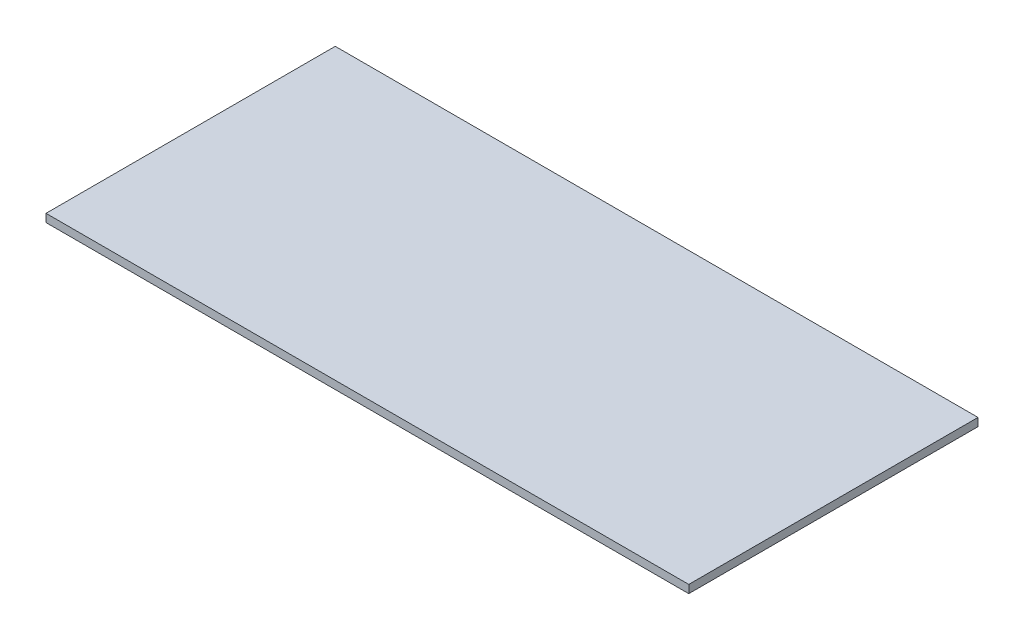
ISO-10303-21;
HEADER;
FILE_DESCRIPTION(('STEP AP214'),'2;1');
FILE_NAME('part.step','',(''),(''),'','','');
FILE_SCHEMA(('AUTOMOTIVE_DESIGN { 1 0 10303 214 1 1 1 1 }'));
ENDSEC;
DATA;
#1=APPLICATION_CONTEXT('core data for automotive mechanical design processes');
#2=APPLICATION_PROTOCOL_DEFINITION('international standard','automotive_design',2000,#1);
#3=PRODUCT_CONTEXT('',#1,'mechanical');
#4=PRODUCT('Part','Part','',(#3));
#5=PRODUCT_RELATED_PRODUCT_CATEGORY('part','',(#4));
#6=PRODUCT_DEFINITION_FORMATION('','',#4);
#7=PRODUCT_DEFINITION_CONTEXT('part definition',#1,'design');
#8=PRODUCT_DEFINITION('design','',#6,#7);
#9=PRODUCT_DEFINITION_SHAPE('','',#8);
#10=(LENGTH_UNIT() NAMED_UNIT(*) SI_UNIT(.MILLI.,.METRE.));
#11=(NAMED_UNIT(*) PLANE_ANGLE_UNIT() SI_UNIT($,.RADIAN.));
#12=(NAMED_UNIT(*) SI_UNIT($,.STERADIAN.) SOLID_ANGLE_UNIT());
#13=UNCERTAINTY_MEASURE_WITH_UNIT(LENGTH_MEASURE(1.E-05),#10,'distance_accuracy_value','');
#14=(GEOMETRIC_REPRESENTATION_CONTEXT(3) GLOBAL_UNCERTAINTY_ASSIGNED_CONTEXT((#13)) GLOBAL_UNIT_ASSIGNED_CONTEXT((#10,
#11,#12)) REPRESENTATION_CONTEXT('',''));
#15=CARTESIAN_POINT('',(0.,0.,0.));
#16=DIRECTION('',(0.,0.,1.));
#17=DIRECTION('',(1.,0.,0.));
#18=AXIS2_PLACEMENT_3D('',#15,#16,#17);
#19=CARTESIAN_POINT('',(400.,10.,-180.));
#20=DIRECTION('',(-1.,0.,0.));
#21=DIRECTION('',(0.,0.,1.));
#22=AXIS2_PLACEMENT_3D('',#19,#20,#21);
#23=PLANE('',#22);
#24=DIRECTION('',(0.,0.,-1.));
#25=VECTOR('',#24,1.);
#26=CARTESIAN_POINT('',(400.,0.,-180.));
#27=LINE('',#26,#25);
#28=CARTESIAN_POINT('',(400.,0.,180.));
#29=VERTEX_POINT('',#28);
#30=CARTESIAN_POINT('',(400.,0.,-180.));
#31=VERTEX_POINT('',#30);
#32=EDGE_CURVE('E99',#29,#31,#27,.T.);
#33=ORIENTED_EDGE('',*,*,#32,.T.);
#34=DIRECTION('',(0.,-1.,0.));
#35=VECTOR('',#34,1.);
#36=CARTESIAN_POINT('',(400.,10.,-180.));
#37=LINE('',#36,#35);
#38=CARTESIAN_POINT('',(400.,10.,-180.));
#39=VERTEX_POINT('',#38);
#40=EDGE_CURVE('E11',#39,#31,#37,.T.);
#41=ORIENTED_EDGE('',*,*,#40,.F.);
#42=DIRECTION('',(0.,0.,-1.));
#43=VECTOR('',#42,1.);
#44=CARTESIAN_POINT('',(400.,10.,-180.));
#45=LINE('',#44,#43);
#46=CARTESIAN_POINT('',(400.,10.,180.));
#47=VERTEX_POINT('',#46);
#48=EDGE_CURVE('E87',#47,#39,#45,.T.);
#49=ORIENTED_EDGE('',*,*,#48,.F.);
#50=DIRECTION('',(0.,-1.,0.));
#51=VECTOR('',#50,1.);
#52=CARTESIAN_POINT('',(400.,10.,180.));
#53=LINE('',#52,#51);
#54=EDGE_CURVE('E95',#47,#29,#53,.T.);
#55=ORIENTED_EDGE('',*,*,#54,.T.);
#56=EDGE_LOOP('',(#33,#41,#49,#55));
#57=FACE_BOUND('',#56,.T.);
#58=ADVANCED_FACE('F36',(#57),#23,.F.);
#59=CARTESIAN_POINT('',(-400.,10.,-180.));
#60=DIRECTION('',(0.,0.,1.));
#61=DIRECTION('',(1.,0.,0.));
#62=AXIS2_PLACEMENT_3D('',#59,#60,#61);
#63=PLANE('',#62);
#64=DIRECTION('',(-1.,0.,0.));
#65=VECTOR('',#64,1.);
#66=CARTESIAN_POINT('',(-400.,0.,-180.));
#67=LINE('',#66,#65);
#68=CARTESIAN_POINT('',(-400.,0.,-180.));
#69=VERTEX_POINT('',#68);
#70=EDGE_CURVE('E91',#31,#69,#67,.T.);
#71=ORIENTED_EDGE('',*,*,#70,.T.);
#72=DIRECTION('',(0.,-1.,0.));
#73=VECTOR('',#72,1.);
#74=CARTESIAN_POINT('',(-400.,10.,-180.));
#75=LINE('',#74,#73);
#76=CARTESIAN_POINT('',(-400.,10.,-180.));
#77=VERTEX_POINT('',#76);
#78=EDGE_CURVE('E44',#77,#69,#75,.T.);
#79=ORIENTED_EDGE('',*,*,#78,.F.);
#80=DIRECTION('',(-1.,0.,0.));
#81=VECTOR('',#80,1.);
#82=CARTESIAN_POINT('',(-400.,10.,-180.));
#83=LINE('',#82,#81);
#84=EDGE_CURVE('E82',#39,#77,#83,.T.);
#85=ORIENTED_EDGE('',*,*,#84,.F.);
#86=ORIENTED_EDGE('',*,*,#40,.T.);
#87=EDGE_LOOP('',(#71,#79,#85,#86));
#88=FACE_BOUND('',#87,.T.);
#89=ADVANCED_FACE('F90',(#88),#63,.F.);
#90=CARTESIAN_POINT('',(-400.,10.,-180.));
#91=DIRECTION('',(1.,0.,0.));
#92=DIRECTION('',(0.,0.,-1.));
#93=AXIS2_PLACEMENT_3D('',#90,#91,#92);
#94=PLANE('',#93);
#95=DIRECTION('',(0.,0.,1.));
#96=VECTOR('',#95,1.);
#97=CARTESIAN_POINT('',(-400.,0.,-180.));
#98=LINE('',#97,#96);
#99=CARTESIAN_POINT('',(-400.,0.,180.));
#100=VERTEX_POINT('',#99);
#101=EDGE_CURVE('E69',#69,#100,#98,.T.);
#102=ORIENTED_EDGE('',*,*,#101,.T.);
#103=DIRECTION('',(0.,-1.,0.));
#104=VECTOR('',#103,1.);
#105=CARTESIAN_POINT('',(-400.,10.,180.));
#106=LINE('',#105,#104);
#107=CARTESIAN_POINT('',(-400.,10.,180.));
#108=VERTEX_POINT('',#107);
#109=EDGE_CURVE('E92',#108,#100,#106,.T.);
#110=ORIENTED_EDGE('',*,*,#109,.F.);
#111=DIRECTION('',(0.,0.,1.));
#112=VECTOR('',#111,1.);
#113=CARTESIAN_POINT('',(-400.,10.,-180.));
#114=LINE('',#113,#112);
#115=EDGE_CURVE('E85',#77,#108,#114,.T.);
#116=ORIENTED_EDGE('',*,*,#115,.F.);
#117=ORIENTED_EDGE('',*,*,#78,.T.);
#118=EDGE_LOOP('',(#102,#110,#116,#117));
#119=FACE_BOUND('',#118,.T.);
#120=ADVANCED_FACE('F93',(#119),#94,.F.);
#121=CARTESIAN_POINT('',(-400.,10.,180.));
#122=DIRECTION('',(0.,0.,-1.));
#123=DIRECTION('',(-1.,0.,0.));
#124=AXIS2_PLACEMENT_3D('',#121,#122,#123);
#125=PLANE('',#124);
#126=DIRECTION('',(1.,0.,0.));
#127=VECTOR('',#126,1.);
#128=CARTESIAN_POINT('',(-400.,0.,180.));
#129=LINE('',#128,#127);
#130=EDGE_CURVE('E75',#100,#29,#129,.T.);
#131=ORIENTED_EDGE('',*,*,#130,.T.);
#132=ORIENTED_EDGE('',*,*,#54,.F.);
#133=DIRECTION('',(1.,0.,0.));
#134=VECTOR('',#133,1.);
#135=CARTESIAN_POINT('',(-400.,10.,180.));
#136=LINE('',#135,#134);
#137=EDGE_CURVE('E52',#108,#47,#136,.T.);
#138=ORIENTED_EDGE('',*,*,#137,.F.);
#139=ORIENTED_EDGE('',*,*,#109,.T.);
#140=EDGE_LOOP('',(#131,#132,#138,#139));
#141=FACE_BOUND('',#140,.T.);
#142=ADVANCED_FACE('F106',(#141),#125,.F.);
#143=CARTESIAN_POINT('',(0.,10.,0.));
#144=DIRECTION('',(0.,1.,0.));
#145=DIRECTION('',(0.,0.,1.));
#146=AXIS2_PLACEMENT_3D('',#143,#144,#145);
#147=PLANE('',#146);
#148=ORIENTED_EDGE('',*,*,#48,.T.);
#149=ORIENTED_EDGE('',*,*,#84,.T.);
#150=ORIENTED_EDGE('',*,*,#115,.T.);
#151=ORIENTED_EDGE('',*,*,#137,.T.);
#152=EDGE_LOOP('',(#148,#149,#150,#151));
#153=FACE_BOUND('',#152,.T.);
#154=ADVANCED_FACE('F83',(#153),#147,.T.);
#155=CARTESIAN_POINT('',(0.,0.,0.));
#156=DIRECTION('',(0.,1.,0.));
#157=DIRECTION('',(0.,0.,1.));
#158=AXIS2_PLACEMENT_3D('',#155,#156,#157);
#159=PLANE('',#158);
#160=ORIENTED_EDGE('',*,*,#32,.F.);
#161=ORIENTED_EDGE('',*,*,#130,.F.);
#162=ORIENTED_EDGE('',*,*,#101,.F.);
#163=ORIENTED_EDGE('',*,*,#70,.F.);
#164=EDGE_LOOP('',(#160,#161,#162,#163));
#165=FACE_BOUND('',#164,.T.);
#166=ADVANCED_FACE('F109',(#165),#159,.F.);
#167=CLOSED_SHELL('',(#58,#89,#120,#142,#154,#166));
#168=MANIFOLD_SOLID_BREP('B2',#167);
#169=ADVANCED_BREP_SHAPE_REPRESENTATION('',(#18,#168),#14);
#170=SHAPE_DEFINITION_REPRESENTATION(#9,#169);
ENDSEC;
END-ISO-10303-21;
